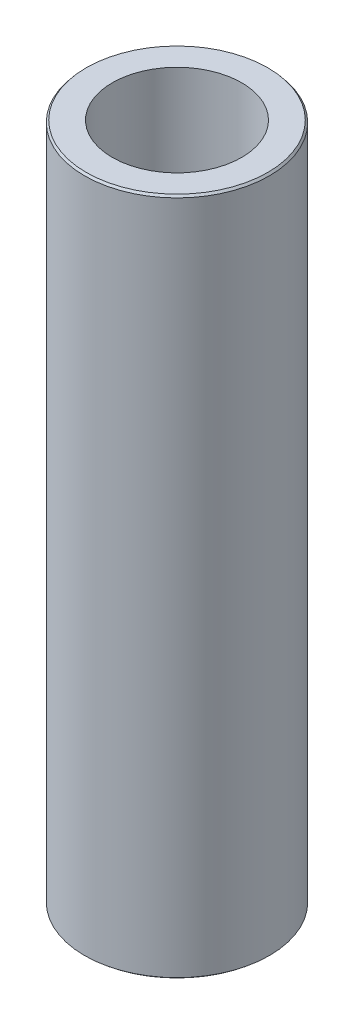
ISO-10303-21;
HEADER;
FILE_DESCRIPTION(('STEP AP214'),'2;1');
FILE_NAME('part.step','',(''),(''),'','','');
FILE_SCHEMA(('AUTOMOTIVE_DESIGN { 1 0 10303 214 1 1 1 1 }'));
ENDSEC;
DATA;
#1=APPLICATION_CONTEXT('core data for automotive mechanical design processes');
#2=APPLICATION_PROTOCOL_DEFINITION('international standard','automotive_design',2000,#1);
#3=PRODUCT_CONTEXT('',#1,'mechanical');
#4=PRODUCT('Part','Part','',(#3));
#5=PRODUCT_RELATED_PRODUCT_CATEGORY('part','',(#4));
#6=PRODUCT_DEFINITION_FORMATION('','',#4);
#7=PRODUCT_DEFINITION_CONTEXT('part definition',#1,'design');
#8=PRODUCT_DEFINITION('design','',#6,#7);
#9=PRODUCT_DEFINITION_SHAPE('','',#8);
#10=(LENGTH_UNIT() NAMED_UNIT(*) SI_UNIT(.MILLI.,.METRE.));
#11=(NAMED_UNIT(*) PLANE_ANGLE_UNIT() SI_UNIT($,.RADIAN.));
#12=(NAMED_UNIT(*) SI_UNIT($,.STERADIAN.) SOLID_ANGLE_UNIT());
#13=UNCERTAINTY_MEASURE_WITH_UNIT(LENGTH_MEASURE(1.E-05),#10,'distance_accuracy_value','');
#14=(GEOMETRIC_REPRESENTATION_CONTEXT(3) GLOBAL_UNCERTAINTY_ASSIGNED_CONTEXT((#13)) GLOBAL_UNIT_ASSIGNED_CONTEXT((#10,
#11,#12)) REPRESENTATION_CONTEXT('',''));
#15=CARTESIAN_POINT('',(0.,0.,0.));
#16=DIRECTION('',(0.,0.,1.));
#17=DIRECTION('',(1.,0.,0.));
#18=AXIS2_PLACEMENT_3D('',#15,#16,#17);
#19=CARTESIAN_POINT('',(0.,440.722868493572,0.));
#20=DIRECTION('',(0.,-1.,0.));
#21=DIRECTION('',(0.,0.,-1.));
#22=AXIS2_PLACEMENT_3D('',#19,#20,#21);
#23=CYLINDRICAL_SURFACE('',#22,60.);
#24=CARTESIAN_POINT('',(0.,439.385565088252,0.));
#25=DIRECTION('',(0.,1.,0.));
#26=DIRECTION('',(0.,0.,1.));
#27=AXIS2_PLACEMENT_3D('',#24,#25,#26);
#28=CIRCLE('',#27,60.);
#29=CARTESIAN_POINT('',(0.,439.385565088252,60.));
#30=VERTEX_POINT('',#29);
#31=EDGE_CURVE('E50',#30,#30,#28,.F.);
#32=ORIENTED_EDGE('',*,*,#31,.T.);
#33=EDGE_LOOP('',(#32));
#34=FACE_BOUND('',#33,.T.);
#35=CARTESIAN_POINT('',(0.,1.11436959006433,0.));
#36=DIRECTION('',(0.,1.,0.));
#37=DIRECTION('',(0.,0.,1.));
#38=AXIS2_PLACEMENT_3D('',#35,#36,#37);
#39=CIRCLE('',#38,60.);
#40=CARTESIAN_POINT('',(0.,1.11436959006433,60.));
#41=VERTEX_POINT('',#40);
#42=EDGE_CURVE('E51',#41,#41,#39,.T.);
#43=ORIENTED_EDGE('',*,*,#42,.T.);
#44=EDGE_LOOP('',(#43));
#45=FACE_BOUND('',#44,.T.);
#46=ADVANCED_FACE('F39',(#34,#45),#23,.T.);
#47=CARTESIAN_POINT('',(0.,440.722868493572,0.));
#48=DIRECTION('',(0.,1.,0.));
#49=DIRECTION('',(0.,0.,1.));
#50=AXIS2_PLACEMENT_3D('',#47,#48,#49);
#51=PLANE('',#50);
#52=CARTESIAN_POINT('',(0.,440.722868493572,0.));
#53=DIRECTION('',(0.,1.,0.));
#54=DIRECTION('',(0.,0.,1.));
#55=AXIS2_PLACEMENT_3D('',#52,#53,#54);
#56=CIRCLE('',#55,58.8856304099358);
#57=CARTESIAN_POINT('',(0.,440.722868493572,58.8856304099358));
#58=VERTEX_POINT('',#57);
#59=EDGE_CURVE('E54',#58,#58,#56,.T.);
#60=ORIENTED_EDGE('',*,*,#59,.T.);
#61=EDGE_LOOP('',(#60));
#62=FACE_BOUND('',#61,.T.);
#63=CARTESIAN_POINT('',(0.,440.722868493572,0.));
#64=DIRECTION('',(0.,1.,0.));
#65=DIRECTION('',(0.,0.,1.));
#66=AXIS2_PLACEMENT_3D('',#63,#64,#65);
#67=CIRCLE('',#66,42.0024866274725);
#68=CARTESIAN_POINT('',(0.,440.722868493572,42.0024866274725));
#69=VERTEX_POINT('',#68);
#70=EDGE_CURVE('E58',#69,#69,#67,.T.);
#71=ORIENTED_EDGE('',*,*,#70,.F.);
#72=EDGE_LOOP('',(#71));
#73=FACE_BOUND('',#72,.T.);
#74=ADVANCED_FACE('F69',(#62,#73),#51,.T.);
#75=CARTESIAN_POINT('',(0.,0.,0.));
#76=DIRECTION('',(0.,1.,0.));
#77=DIRECTION('',(0.,0.,1.));
#78=AXIS2_PLACEMENT_3D('',#75,#76,#77);
#79=PLANE('',#78);
#80=CARTESIAN_POINT('',(0.,0.,0.));
#81=DIRECTION('',(0.,1.,0.));
#82=DIRECTION('',(0.,0.,1.));
#83=AXIS2_PLACEMENT_3D('',#80,#81,#82);
#84=CIRCLE('',#83,58.6626965946799);
#85=CARTESIAN_POINT('',(0.,0.,58.6626965946799));
#86=VERTEX_POINT('',#85);
#87=EDGE_CURVE('E10',#86,#86,#84,.F.);
#88=ORIENTED_EDGE('',*,*,#87,.T.);
#89=EDGE_LOOP('',(#88));
#90=FACE_BOUND('',#89,.T.);
#91=CARTESIAN_POINT('',(0.,0.,0.));
#92=DIRECTION('',(0.,1.,0.));
#93=DIRECTION('',(0.,0.,1.));
#94=AXIS2_PLACEMENT_3D('',#91,#92,#93);
#95=CIRCLE('',#94,42.0024866274725);
#96=CARTESIAN_POINT('',(0.,0.,42.0024866274725));
#97=VERTEX_POINT('',#96);
#98=EDGE_CURVE('E63',#97,#97,#95,.T.);
#99=ORIENTED_EDGE('',*,*,#98,.T.);
#100=EDGE_LOOP('',(#99));
#101=FACE_BOUND('',#100,.T.);
#102=ADVANCED_FACE('F75',(#90,#101),#79,.F.);
#103=CARTESIAN_POINT('',(0.,440.722868493572,0.));
#104=DIRECTION('',(0.,-1.,0.));
#105=DIRECTION('',(0.,0.,-1.));
#106=AXIS2_PLACEMENT_3D('',#103,#104,#105);
#107=CYLINDRICAL_SURFACE('',#106,42.0024866274725);
#108=ORIENTED_EDGE('',*,*,#70,.T.);
#109=EDGE_LOOP('',(#108));
#110=FACE_BOUND('',#109,.T.);
#111=ORIENTED_EDGE('',*,*,#98,.F.);
#112=EDGE_LOOP('',(#111));
#113=FACE_BOUND('',#112,.T.);
#114=ADVANCED_FACE('F70',(#110,#113),#107,.F.);
#115=CARTESIAN_POINT('',(0.,440.722868493572,0.));
#116=DIRECTION('',(0.,-1.,0.));
#117=DIRECTION('',(0.,0.,-1.));
#118=AXIS2_PLACEMENT_3D('',#115,#116,#117);
#119=CONICAL_SURFACE('',#118,58.8856304099358,0.694716248135541);
#120=ORIENTED_EDGE('',*,*,#31,.F.);
#121=EDGE_LOOP('',(#120));
#122=FACE_BOUND('',#121,.T.);
#123=ORIENTED_EDGE('',*,*,#59,.F.);
#124=EDGE_LOOP('',(#123));
#125=FACE_BOUND('',#124,.T.);
#126=ADVANCED_FACE('F81',(#122,#125),#119,.T.);
#127=CARTESIAN_POINT('',(0.,1.11436959006433,0.));
#128=DIRECTION('',(0.,1.,0.));
#129=DIRECTION('',(0.,0.,1.));
#130=AXIS2_PLACEMENT_3D('',#127,#128,#129);
#131=CONICAL_SURFACE('',#130,60.,0.876080078659348);
#132=ORIENTED_EDGE('',*,*,#87,.F.);
#133=EDGE_LOOP('',(#132));
#134=FACE_BOUND('',#133,.T.);
#135=ORIENTED_EDGE('',*,*,#42,.F.);
#136=EDGE_LOOP('',(#135));
#137=FACE_BOUND('',#136,.T.);
#138=ADVANCED_FACE('F45',(#134,#137),#131,.T.);
#139=CLOSED_SHELL('',(#46,#74,#102,#114,#126,#138));
#140=MANIFOLD_SOLID_BREP('B2',#139);
#141=ADVANCED_BREP_SHAPE_REPRESENTATION('',(#18,#140),#14);
#142=SHAPE_DEFINITION_REPRESENTATION(#9,#141);
ENDSEC;
END-ISO-10303-21;
